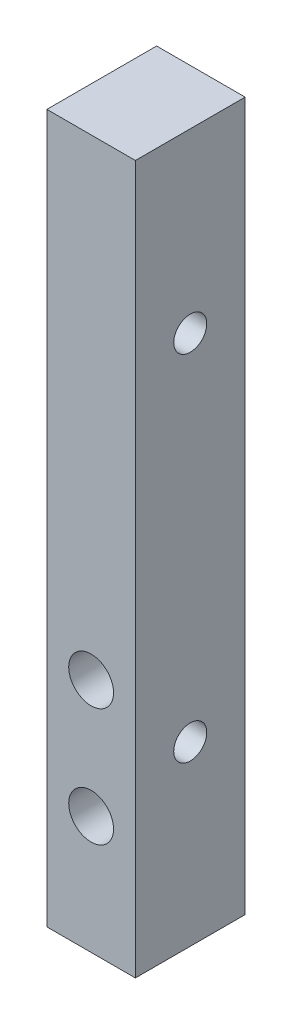
ISO-10303-21;
HEADER;
FILE_DESCRIPTION(('STEP AP214'),'2;1');
FILE_NAME('part.step','',(''),(''),'','','');
FILE_SCHEMA(('AUTOMOTIVE_DESIGN { 1 0 10303 214 1 1 1 1 }'));
ENDSEC;
DATA;
#1=APPLICATION_CONTEXT('core data for automotive mechanical design processes');
#2=APPLICATION_PROTOCOL_DEFINITION('international standard','automotive_design',2000,#1);
#3=PRODUCT_CONTEXT('',#1,'mechanical');
#4=PRODUCT('Part','Part','',(#3));
#5=PRODUCT_RELATED_PRODUCT_CATEGORY('part','',(#4));
#6=PRODUCT_DEFINITION_FORMATION('','',#4);
#7=PRODUCT_DEFINITION_CONTEXT('part definition',#1,'design');
#8=PRODUCT_DEFINITION('design','',#6,#7);
#9=PRODUCT_DEFINITION_SHAPE('','',#8);
#10=(LENGTH_UNIT() NAMED_UNIT(*) SI_UNIT(.MILLI.,.METRE.));
#11=(NAMED_UNIT(*) PLANE_ANGLE_UNIT() SI_UNIT($,.RADIAN.));
#12=(NAMED_UNIT(*) SI_UNIT($,.STERADIAN.) SOLID_ANGLE_UNIT());
#13=UNCERTAINTY_MEASURE_WITH_UNIT(LENGTH_MEASURE(1.E-05),#10,'distance_accuracy_value','');
#14=(GEOMETRIC_REPRESENTATION_CONTEXT(3) GLOBAL_UNCERTAINTY_ASSIGNED_CONTEXT((#13)) GLOBAL_UNIT_ASSIGNED_CONTEXT((#10,
#11,#12)) REPRESENTATION_CONTEXT('',''));
#15=CARTESIAN_POINT('',(0.,0.,0.));
#16=DIRECTION('',(0.,0.,1.));
#17=DIRECTION('',(1.,0.,0.));
#18=AXIS2_PLACEMENT_3D('',#15,#16,#17);
#19=CARTESIAN_POINT('',(0.,0.,11.811));
#20=DIRECTION('',(1.,0.,0.));
#21=DIRECTION('',(0.,0.,-1.));
#22=AXIS2_PLACEMENT_3D('',#19,#20,#21);
#23=PLANE('',#22);
#24=CARTESIAN_POINT('',(0.,19.05,5.9055));
#25=DIRECTION('',(-1.,0.,0.));
#26=DIRECTION('',(0.,0.,1.));
#27=AXIS2_PLACEMENT_3D('',#24,#25,#26);
#28=CIRCLE('',#27,1.778);
#29=CARTESIAN_POINT('',(0.,19.05,7.6835));
#30=VERTEX_POINT('',#29);
#31=EDGE_CURVE('E118',#30,#30,#28,.T.);
#32=ORIENTED_EDGE('',*,*,#31,.F.);
#33=EDGE_LOOP('',(#32));
#34=FACE_BOUND('',#33,.T.);
#35=CARTESIAN_POINT('',(0.,57.15,5.90549999999999));
#36=DIRECTION('',(-1.,0.,0.));
#37=DIRECTION('',(0.,0.,1.));
#38=AXIS2_PLACEMENT_3D('',#35,#36,#37);
#39=CIRCLE('',#38,1.778);
#40=CARTESIAN_POINT('',(0.,57.15,7.68349999999999));
#41=VERTEX_POINT('',#40);
#42=EDGE_CURVE('E112',#41,#41,#39,.T.);
#43=ORIENTED_EDGE('',*,*,#42,.F.);
#44=EDGE_LOOP('',(#43));
#45=FACE_BOUND('',#44,.T.);
#46=DIRECTION('',(0.,-1.,0.));
#47=VECTOR('',#46,1.);
#48=CARTESIAN_POINT('',(0.,0.,0.));
#49=LINE('',#48,#47);
#50=CARTESIAN_POINT('',(0.,76.2,0.));
#51=VERTEX_POINT('',#50);
#52=CARTESIAN_POINT('',(0.,0.,0.));
#53=VERTEX_POINT('',#52);
#54=EDGE_CURVE('E98',#51,#53,#49,.T.);
#55=ORIENTED_EDGE('',*,*,#54,.T.);
#56=DIRECTION('',(0.,0.,-1.));
#57=VECTOR('',#56,1.);
#58=CARTESIAN_POINT('',(0.,0.,11.811));
#59=LINE('',#58,#57);
#60=CARTESIAN_POINT('',(0.,0.,11.811));
#61=VERTEX_POINT('',#60);
#62=EDGE_CURVE('E11',#61,#53,#59,.T.);
#63=ORIENTED_EDGE('',*,*,#62,.F.);
#64=DIRECTION('',(0.,-1.,0.));
#65=VECTOR('',#64,1.);
#66=CARTESIAN_POINT('',(0.,0.,11.811));
#67=LINE('',#66,#65);
#68=CARTESIAN_POINT('',(0.,76.2,11.811));
#69=VERTEX_POINT('',#68);
#70=EDGE_CURVE('E86',#69,#61,#67,.T.);
#71=ORIENTED_EDGE('',*,*,#70,.F.);
#72=DIRECTION('',(0.,0.,-1.));
#73=VECTOR('',#72,1.);
#74=CARTESIAN_POINT('',(0.,76.2,11.811));
#75=LINE('',#74,#73);
#76=EDGE_CURVE('E94',#69,#51,#75,.T.);
#77=ORIENTED_EDGE('',*,*,#76,.T.);
#78=EDGE_LOOP('',(#55,#63,#71,#77));
#79=FACE_BOUND('',#78,.T.);
#80=ADVANCED_FACE('F35',(#34,#45,#79),#23,.F.);
#81=CARTESIAN_POINT('',(0.,0.,11.811));
#82=DIRECTION('',(0.,1.,0.));
#83=DIRECTION('',(0.,0.,1.));
#84=AXIS2_PLACEMENT_3D('',#81,#82,#83);
#85=PLANE('',#84);
#86=DIRECTION('',(1.,0.,0.));
#87=VECTOR('',#86,1.);
#88=CARTESIAN_POINT('',(0.,0.,0.));
#89=LINE('',#88,#87);
#90=CARTESIAN_POINT('',(9.525,0.,0.));
#91=VERTEX_POINT('',#90);
#92=EDGE_CURVE('E90',#53,#91,#89,.T.);
#93=ORIENTED_EDGE('',*,*,#92,.T.);
#94=DIRECTION('',(0.,0.,-1.));
#95=VECTOR('',#94,1.);
#96=CARTESIAN_POINT('',(9.525,0.,11.811));
#97=LINE('',#96,#95);
#98=CARTESIAN_POINT('',(9.525,0.,11.811));
#99=VERTEX_POINT('',#98);
#100=EDGE_CURVE('E43',#99,#91,#97,.T.);
#101=ORIENTED_EDGE('',*,*,#100,.F.);
#102=DIRECTION('',(1.,0.,0.));
#103=VECTOR('',#102,1.);
#104=CARTESIAN_POINT('',(0.,0.,11.811));
#105=LINE('',#104,#103);
#106=EDGE_CURVE('E81',#61,#99,#105,.T.);
#107=ORIENTED_EDGE('',*,*,#106,.F.);
#108=ORIENTED_EDGE('',*,*,#62,.T.);
#109=EDGE_LOOP('',(#93,#101,#107,#108));
#110=FACE_BOUND('',#109,.T.);
#111=ADVANCED_FACE('F89',(#110),#85,.F.);
#112=CARTESIAN_POINT('',(9.525,0.,11.811));
#113=DIRECTION('',(-1.,0.,0.));
#114=DIRECTION('',(0.,0.,1.));
#115=AXIS2_PLACEMENT_3D('',#112,#113,#114);
#116=PLANE('',#115);
#117=CARTESIAN_POINT('',(9.525,19.05,5.9055));
#118=DIRECTION('',(-1.,0.,0.));
#119=DIRECTION('',(0.,0.,1.));
#120=AXIS2_PLACEMENT_3D('',#117,#118,#119);
#121=CIRCLE('',#120,1.778);
#122=CARTESIAN_POINT('',(9.525,19.05,7.6835));
#123=VERTEX_POINT('',#122);
#124=EDGE_CURVE('E115',#123,#123,#121,.T.);
#125=ORIENTED_EDGE('',*,*,#124,.T.);
#126=EDGE_LOOP('',(#125));
#127=FACE_BOUND('',#126,.T.);
#128=CARTESIAN_POINT('',(9.525,57.15,5.90549999999999));
#129=DIRECTION('',(-1.,0.,0.));
#130=DIRECTION('',(0.,0.,1.));
#131=AXIS2_PLACEMENT_3D('',#128,#129,#130);
#132=CIRCLE('',#131,1.778);
#133=CARTESIAN_POINT('',(9.525,57.15,7.68349999999999));
#134=VERTEX_POINT('',#133);
#135=EDGE_CURVE('E101',#134,#134,#132,.T.);
#136=ORIENTED_EDGE('',*,*,#135,.T.);
#137=EDGE_LOOP('',(#136));
#138=FACE_BOUND('',#137,.T.);
#139=DIRECTION('',(0.,1.,0.));
#140=VECTOR('',#139,1.);
#141=CARTESIAN_POINT('',(9.525,0.,0.));
#142=LINE('',#141,#140);
#143=CARTESIAN_POINT('',(9.525,76.2,0.));
#144=VERTEX_POINT('',#143);
#145=EDGE_CURVE('E68',#91,#144,#142,.T.);
#146=ORIENTED_EDGE('',*,*,#145,.T.);
#147=DIRECTION('',(0.,0.,-1.));
#148=VECTOR('',#147,1.);
#149=CARTESIAN_POINT('',(9.525,76.2,11.811));
#150=LINE('',#149,#148);
#151=CARTESIAN_POINT('',(9.525,76.2,11.811));
#152=VERTEX_POINT('',#151);
#153=EDGE_CURVE('E91',#152,#144,#150,.T.);
#154=ORIENTED_EDGE('',*,*,#153,.F.);
#155=DIRECTION('',(0.,1.,0.));
#156=VECTOR('',#155,1.);
#157=CARTESIAN_POINT('',(9.525,0.,11.811));
#158=LINE('',#157,#156);
#159=EDGE_CURVE('E84',#99,#152,#158,.T.);
#160=ORIENTED_EDGE('',*,*,#159,.F.);
#161=ORIENTED_EDGE('',*,*,#100,.T.);
#162=EDGE_LOOP('',(#146,#154,#160,#161));
#163=FACE_BOUND('',#162,.T.);
#164=ADVANCED_FACE('F92',(#127,#138,#163),#116,.F.);
#165=CARTESIAN_POINT('',(0.,76.2,11.811));
#166=DIRECTION('',(0.,-1.,0.));
#167=DIRECTION('',(0.,0.,-1.));
#168=AXIS2_PLACEMENT_3D('',#165,#166,#167);
#169=PLANE('',#168);
#170=DIRECTION('',(-1.,0.,0.));
#171=VECTOR('',#170,1.);
#172=CARTESIAN_POINT('',(0.,76.2,0.));
#173=LINE('',#172,#171);
#174=EDGE_CURVE('E74',#144,#51,#173,.T.);
#175=ORIENTED_EDGE('',*,*,#174,.T.);
#176=ORIENTED_EDGE('',*,*,#76,.F.);
#177=DIRECTION('',(-1.,0.,0.));
#178=VECTOR('',#177,1.);
#179=CARTESIAN_POINT('',(0.,76.2,11.811));
#180=LINE('',#179,#178);
#181=EDGE_CURVE('E51',#152,#69,#180,.T.);
#182=ORIENTED_EDGE('',*,*,#181,.F.);
#183=ORIENTED_EDGE('',*,*,#153,.T.);
#184=EDGE_LOOP('',(#175,#176,#182,#183));
#185=FACE_BOUND('',#184,.T.);
#186=ADVANCED_FACE('F106',(#185),#169,.F.);
#187=CARTESIAN_POINT('',(0.,0.,11.811));
#188=DIRECTION('',(0.,0.,-1.));
#189=DIRECTION('',(-1.,0.,0.));
#190=AXIS2_PLACEMENT_3D('',#187,#188,#189);
#191=PLANE('',#190);
#192=CARTESIAN_POINT('',(4.7625,12.7,11.811));
#193=DIRECTION('',(0.,0.,-1.));
#194=DIRECTION('',(-1.,0.,0.));
#195=AXIS2_PLACEMENT_3D('',#192,#193,#194);
#196=CIRCLE('',#195,2.413);
#197=CARTESIAN_POINT('',(2.3495,12.7,11.811));
#198=VERTEX_POINT('',#197);
#199=EDGE_CURVE('E127',#198,#198,#196,.T.);
#200=ORIENTED_EDGE('',*,*,#199,.T.);
#201=EDGE_LOOP('',(#200));
#202=FACE_BOUND('',#201,.T.);
#203=CARTESIAN_POINT('',(4.7625,25.4,11.811));
#204=DIRECTION('',(0.,0.,-1.));
#205=DIRECTION('',(-1.,0.,0.));
#206=AXIS2_PLACEMENT_3D('',#203,#204,#205);
#207=CIRCLE('',#206,2.413);
#208=CARTESIAN_POINT('',(2.3495,25.4,11.811));
#209=VERTEX_POINT('',#208);
#210=EDGE_CURVE('E121',#209,#209,#207,.T.);
#211=ORIENTED_EDGE('',*,*,#210,.T.);
#212=EDGE_LOOP('',(#211));
#213=FACE_BOUND('',#212,.T.);
#214=ORIENTED_EDGE('',*,*,#70,.T.);
#215=ORIENTED_EDGE('',*,*,#106,.T.);
#216=ORIENTED_EDGE('',*,*,#159,.T.);
#217=ORIENTED_EDGE('',*,*,#181,.T.);
#218=EDGE_LOOP('',(#214,#215,#216,#217));
#219=FACE_BOUND('',#218,.T.);
#220=ADVANCED_FACE('F82',(#202,#213,#219),#191,.F.);
#221=CARTESIAN_POINT('',(0.,0.,0.));
#222=DIRECTION('',(0.,0.,-1.));
#223=DIRECTION('',(-1.,0.,0.));
#224=AXIS2_PLACEMENT_3D('',#221,#222,#223);
#225=PLANE('',#224);
#226=CARTESIAN_POINT('',(4.7625,12.7,0.));
#227=DIRECTION('',(0.,0.,-1.));
#228=DIRECTION('',(-1.,0.,0.));
#229=AXIS2_PLACEMENT_3D('',#226,#227,#228);
#230=CIRCLE('',#229,2.413);
#231=CARTESIAN_POINT('',(2.3495,12.7,0.));
#232=VERTEX_POINT('',#231);
#233=EDGE_CURVE('E130',#232,#232,#230,.T.);
#234=ORIENTED_EDGE('',*,*,#233,.F.);
#235=EDGE_LOOP('',(#234));
#236=FACE_BOUND('',#235,.T.);
#237=CARTESIAN_POINT('',(4.7625,25.4,0.));
#238=DIRECTION('',(0.,0.,-1.));
#239=DIRECTION('',(-1.,0.,0.));
#240=AXIS2_PLACEMENT_3D('',#237,#238,#239);
#241=CIRCLE('',#240,2.413);
#242=CARTESIAN_POINT('',(2.3495,25.4,0.));
#243=VERTEX_POINT('',#242);
#244=EDGE_CURVE('E124',#243,#243,#241,.T.);
#245=ORIENTED_EDGE('',*,*,#244,.F.);
#246=EDGE_LOOP('',(#245));
#247=FACE_BOUND('',#246,.T.);
#248=ORIENTED_EDGE('',*,*,#54,.F.);
#249=ORIENTED_EDGE('',*,*,#174,.F.);
#250=ORIENTED_EDGE('',*,*,#145,.F.);
#251=ORIENTED_EDGE('',*,*,#92,.F.);
#252=EDGE_LOOP('',(#248,#249,#250,#251));
#253=FACE_BOUND('',#252,.T.);
#254=ADVANCED_FACE('F109',(#236,#247,#253),#225,.T.);
#255=CARTESIAN_POINT('',(9.525,57.15,5.90549999999999));
#256=DIRECTION('',(-1.,0.,0.));
#257=DIRECTION('',(0.,0.,1.));
#258=AXIS2_PLACEMENT_3D('',#255,#256,#257);
#259=CYLINDRICAL_SURFACE('',#258,1.778);
#260=ORIENTED_EDGE('',*,*,#135,.F.);
#261=EDGE_LOOP('',(#260));
#262=FACE_BOUND('',#261,.T.);
#263=ORIENTED_EDGE('',*,*,#42,.T.);
#264=EDGE_LOOP('',(#263));
#265=FACE_BOUND('',#264,.T.);
#266=ADVANCED_FACE('F147',(#262,#265),#259,.F.);
#267=CARTESIAN_POINT('',(9.525,19.05,5.9055));
#268=DIRECTION('',(-1.,0.,0.));
#269=DIRECTION('',(0.,0.,1.));
#270=AXIS2_PLACEMENT_3D('',#267,#268,#269);
#271=CYLINDRICAL_SURFACE('',#270,1.778);
#272=ORIENTED_EDGE('',*,*,#124,.F.);
#273=EDGE_LOOP('',(#272));
#274=FACE_BOUND('',#273,.T.);
#275=ORIENTED_EDGE('',*,*,#31,.T.);
#276=EDGE_LOOP('',(#275));
#277=FACE_BOUND('',#276,.T.);
#278=ADVANCED_FACE('F152',(#274,#277),#271,.F.);
#279=CARTESIAN_POINT('',(4.7625,25.4,11.811));
#280=DIRECTION('',(0.,0.,-1.));
#281=DIRECTION('',(-1.,0.,0.));
#282=AXIS2_PLACEMENT_3D('',#279,#280,#281);
#283=CYLINDRICAL_SURFACE('',#282,2.413);
#284=ORIENTED_EDGE('',*,*,#210,.F.);
#285=EDGE_LOOP('',(#284));
#286=FACE_BOUND('',#285,.T.);
#287=ORIENTED_EDGE('',*,*,#244,.T.);
#288=EDGE_LOOP('',(#287));
#289=FACE_BOUND('',#288,.T.);
#290=ADVANCED_FACE('F141',(#286,#289),#283,.F.);
#291=CARTESIAN_POINT('',(4.7625,12.7,11.811));
#292=DIRECTION('',(0.,0.,-1.));
#293=DIRECTION('',(-1.,0.,0.));
#294=AXIS2_PLACEMENT_3D('',#291,#292,#293);
#295=CYLINDRICAL_SURFACE('',#294,2.413);
#296=ORIENTED_EDGE('',*,*,#199,.F.);
#297=EDGE_LOOP('',(#296));
#298=FACE_BOUND('',#297,.T.);
#299=ORIENTED_EDGE('',*,*,#233,.T.);
#300=EDGE_LOOP('',(#299));
#301=FACE_BOUND('',#300,.T.);
#302=ADVANCED_FACE('F138',(#298,#301),#295,.F.);
#303=CLOSED_SHELL('',(#80,#111,#164,#186,#220,#254,#266,#278,#290,#302));
#304=MANIFOLD_SOLID_BREP('B2',#303);
#305=ADVANCED_BREP_SHAPE_REPRESENTATION('',(#18,#304),#14);
#306=SHAPE_DEFINITION_REPRESENTATION(#9,#305);
ENDSEC;
END-ISO-10303-21;
